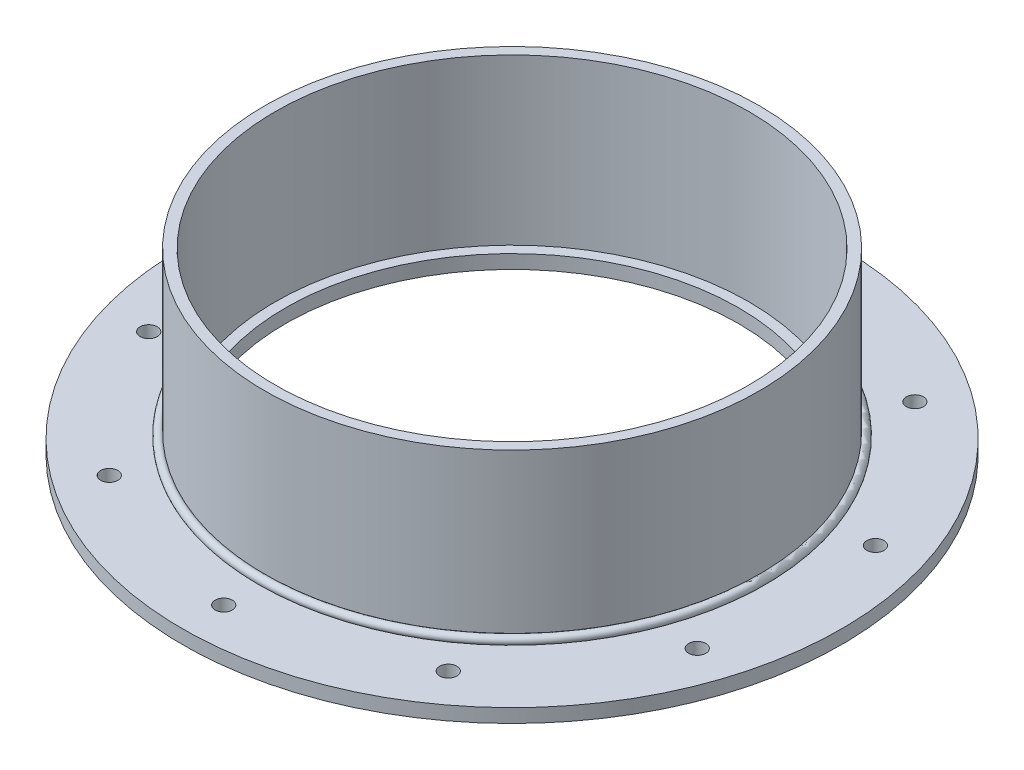
ISO-10303-21;
HEADER;
FILE_DESCRIPTION(('STEP AP214'),'2;1');
FILE_NAME('part.step','',(''),(''),'','','');
FILE_SCHEMA(('AUTOMOTIVE_DESIGN { 1 0 10303 214 1 1 1 1 }'));
ENDSEC;
DATA;
#1=APPLICATION_CONTEXT('core data for automotive mechanical design processes');
#2=APPLICATION_PROTOCOL_DEFINITION('international standard','automotive_design',2000,#1);
#3=PRODUCT_CONTEXT('',#1,'mechanical');
#4=PRODUCT('Part','Part','',(#3));
#5=PRODUCT_RELATED_PRODUCT_CATEGORY('part','',(#4));
#6=PRODUCT_DEFINITION_FORMATION('','',#4);
#7=PRODUCT_DEFINITION_CONTEXT('part definition',#1,'design');
#8=PRODUCT_DEFINITION('design','',#6,#7);
#9=PRODUCT_DEFINITION_SHAPE('','',#8);
#10=(LENGTH_UNIT() NAMED_UNIT(*) SI_UNIT(.MILLI.,.METRE.));
#11=(NAMED_UNIT(*) PLANE_ANGLE_UNIT() SI_UNIT($,.RADIAN.));
#12=(NAMED_UNIT(*) SI_UNIT($,.STERADIAN.) SOLID_ANGLE_UNIT());
#13=UNCERTAINTY_MEASURE_WITH_UNIT(LENGTH_MEASURE(1.E-05),#10,'distance_accuracy_value','');
#14=(GEOMETRIC_REPRESENTATION_CONTEXT(3) GLOBAL_UNCERTAINTY_ASSIGNED_CONTEXT((#13)) GLOBAL_UNIT_ASSIGNED_CONTEXT((#10,
#11,#12)) REPRESENTATION_CONTEXT('',''));
#15=CARTESIAN_POINT('',(0.,0.,0.));
#16=DIRECTION('',(0.,0.,1.));
#17=DIRECTION('',(1.,0.,0.));
#18=AXIS2_PLACEMENT_3D('',#15,#16,#17);
#19=CARTESIAN_POINT('',(0.,7.57337288963903,0.));
#20=DIRECTION('',(0.,-1.,0.));
#21=DIRECTION('',(0.,0.,-1.));
#22=AXIS2_PLACEMENT_3D('',#19,#20,#21);
#23=TOROIDAL_SURFACE('',#22,115.523372889639,1.98437499999999);
#24=CARTESIAN_POINT('',(0.,6.34999999999999,0.));
#25=DIRECTION('',(0.,-1.,0.));
#26=DIRECTION('',(0.,0.,-1.));
#27=AXIS2_PLACEMENT_3D('',#24,#25,#26);
#28=CIRCLE('',#27,117.085775818951);
#29=CARTESIAN_POINT('',(0.,6.34999999999999,-117.085775818951));
#30=VERTEX_POINT('',#29);
#31=EDGE_CURVE('E11',#30,#30,#28,.T.);
#32=ORIENTED_EDGE('',*,*,#31,.F.);
#33=EDGE_LOOP('',(#32));
#34=FACE_BOUND('',#33,.T.);
#35=CARTESIAN_POINT('',(0.,9.13577581895054,0.));
#36=DIRECTION('',(0.,-1.,0.));
#37=DIRECTION('',(0.,0.,-1.));
#38=AXIS2_PLACEMENT_3D('',#35,#36,#37);
#39=CIRCLE('',#38,114.3);
#40=CARTESIAN_POINT('',(0.,9.13577581895054,-114.3));
#41=VERTEX_POINT('',#40);
#42=EDGE_CURVE('E61',#41,#41,#39,.T.);
#43=ORIENTED_EDGE('',*,*,#42,.T.);
#44=EDGE_LOOP('',(#43));
#45=FACE_BOUND('',#44,.T.);
#46=ADVANCED_FACE('F48',(#34,#45),#23,.T.);
#47=CARTESIAN_POINT('',(-114.3,6.34999999999999,0.));
#48=DIRECTION('',(0.,1.,0.));
#49=DIRECTION('',(0.,0.,1.));
#50=AXIS2_PLACEMENT_3D('',#47,#48,#49);
#51=PLANE('',#50);
#52=CARTESIAN_POINT('',(0.,6.34999999999999,0.));
#53=DIRECTION('',(0.,-1.,0.));
#54=DIRECTION('',(0.,0.,-1.));
#55=AXIS2_PLACEMENT_3D('',#52,#53,#54);
#56=CIRCLE('',#55,114.3);
#57=CARTESIAN_POINT('',(0.,6.34999999999999,-114.3));
#58=VERTEX_POINT('',#57);
#59=EDGE_CURVE('E55',#58,#58,#56,.T.);
#60=ORIENTED_EDGE('',*,*,#59,.F.);
#61=EDGE_LOOP('',(#60));
#62=FACE_BOUND('',#61,.T.);
#63=ORIENTED_EDGE('',*,*,#31,.T.);
#64=EDGE_LOOP('',(#63));
#65=FACE_BOUND('',#64,.T.);
#66=ADVANCED_FACE('F74',(#62,#65),#51,.F.);
#67=CARTESIAN_POINT('',(0.,0.,0.));
#68=DIRECTION('',(0.,-1.,0.));
#69=DIRECTION('',(0.,0.,-1.));
#70=AXIS2_PLACEMENT_3D('',#67,#68,#69);
#71=CYLINDRICAL_SURFACE('',#70,114.3);
#72=ORIENTED_EDGE('',*,*,#42,.F.);
#73=EDGE_LOOP('',(#72));
#74=FACE_BOUND('',#73,.T.);
#75=ORIENTED_EDGE('',*,*,#59,.T.);
#76=EDGE_LOOP('',(#75));
#77=FACE_BOUND('',#76,.T.);
#78=ADVANCED_FACE('F72',(#74,#77),#71,.F.);
#79=CLOSED_SHELL('',(#46,#66,#78));
#80=MANIFOLD_SOLID_BREP('B2',#79);
#81=CARTESIAN_POINT('',(0.,0.,0.));
#82=DIRECTION('',(0.,-1.,0.));
#83=DIRECTION('',(0.,0.,-1.));
#84=AXIS2_PLACEMENT_3D('',#81,#82,#83);
#85=CYLINDRICAL_SURFACE('',#84,114.3);
#86=CARTESIAN_POINT('',(0.,6.34999999999999,0.));
#87=DIRECTION('',(0.,-1.,0.));
#88=DIRECTION('',(0.,0.,-1.));
#89=AXIS2_PLACEMENT_3D('',#86,#87,#88);
#90=CIRCLE('',#89,114.3);
#91=CARTESIAN_POINT('',(0.,6.34999999999999,-114.3));
#92=VERTEX_POINT('',#91);
#93=EDGE_CURVE('E133',#92,#92,#90,.T.);
#94=ORIENTED_EDGE('',*,*,#93,.F.);
#95=EDGE_LOOP('',(#94));
#96=FACE_BOUND('',#95,.T.);
#97=CARTESIAN_POINT('',(0.,82.55,0.));
#98=DIRECTION('',(0.,-1.,0.));
#99=DIRECTION('',(0.,0.,-1.));
#100=AXIS2_PLACEMENT_3D('',#97,#98,#99);
#101=CIRCLE('',#100,114.3);
#102=CARTESIAN_POINT('',(0.,82.55,-114.3));
#103=VERTEX_POINT('',#102);
#104=EDGE_CURVE('E47',#103,#103,#101,.T.);
#105=ORIENTED_EDGE('',*,*,#104,.T.);
#106=EDGE_LOOP('',(#105));
#107=FACE_BOUND('',#106,.T.);
#108=ADVANCED_FACE('F114',(#96,#107),#85,.T.);
#109=CARTESIAN_POINT('',(-114.3,82.55,0.));
#110=DIRECTION('',(0.,-1.,0.));
#111=DIRECTION('',(0.,0.,-1.));
#112=AXIS2_PLACEMENT_3D('',#109,#110,#111);
#113=PLANE('',#112);
#114=ORIENTED_EDGE('',*,*,#104,.F.);
#115=EDGE_LOOP('',(#114));
#116=FACE_BOUND('',#115,.T.);
#117=CARTESIAN_POINT('',(0.,82.55,0.));
#118=DIRECTION('',(0.,-1.,0.));
#119=DIRECTION('',(0.,0.,-1.));
#120=AXIS2_PLACEMENT_3D('',#117,#118,#119);
#121=CIRCLE('',#120,109.5375);
#122=CARTESIAN_POINT('',(0.,82.55,-109.5375));
#123=VERTEX_POINT('',#122);
#124=EDGE_CURVE('E121',#123,#123,#121,.T.);
#125=ORIENTED_EDGE('',*,*,#124,.T.);
#126=EDGE_LOOP('',(#125));
#127=FACE_BOUND('',#126,.T.);
#128=ADVANCED_FACE('F144',(#116,#127),#113,.F.);
#129=CARTESIAN_POINT('',(0.,0.,0.));
#130=DIRECTION('',(0.,-1.,0.));
#131=DIRECTION('',(0.,0.,-1.));
#132=AXIS2_PLACEMENT_3D('',#129,#130,#131);
#133=CYLINDRICAL_SURFACE('',#132,109.5375);
#134=ORIENTED_EDGE('',*,*,#124,.F.);
#135=EDGE_LOOP('',(#134));
#136=FACE_BOUND('',#135,.T.);
#137=CARTESIAN_POINT('',(0.,6.34999999999999,0.));
#138=DIRECTION('',(0.,-1.,0.));
#139=DIRECTION('',(0.,0.,-1.));
#140=AXIS2_PLACEMENT_3D('',#137,#138,#139);
#141=CIRCLE('',#140,109.5375);
#142=CARTESIAN_POINT('',(0.,6.34999999999999,-109.5375));
#143=VERTEX_POINT('',#142);
#144=EDGE_CURVE('E127',#143,#143,#141,.T.);
#145=ORIENTED_EDGE('',*,*,#144,.T.);
#146=EDGE_LOOP('',(#145));
#147=FACE_BOUND('',#146,.T.);
#148=ADVANCED_FACE('F148',(#136,#147),#133,.F.);
#149=CARTESIAN_POINT('',(-114.3,6.34999999999999,0.));
#150=DIRECTION('',(0.,1.,0.));
#151=DIRECTION('',(0.,0.,1.));
#152=AXIS2_PLACEMENT_3D('',#149,#150,#151);
#153=PLANE('',#152);
#154=ORIENTED_EDGE('',*,*,#144,.F.);
#155=EDGE_LOOP('',(#154));
#156=FACE_BOUND('',#155,.T.);
#157=ORIENTED_EDGE('',*,*,#93,.T.);
#158=EDGE_LOOP('',(#157));
#159=FACE_BOUND('',#158,.T.);
#160=ADVANCED_FACE('F141',(#156,#159),#153,.F.);
#161=CLOSED_SHELL('',(#108,#128,#148,#160));
#162=MANIFOLD_SOLID_BREP('B6',#161);
#163=CARTESIAN_POINT('',(0.,0.,0.));
#164=DIRECTION('',(0.,-1.,0.));
#165=DIRECTION('',(0.,0.,-1.));
#166=AXIS2_PLACEMENT_3D('',#163,#164,#165);
#167=CYLINDRICAL_SURFACE('',#166,104.775);
#168=CARTESIAN_POINT('',(0.,6.34999999999999,0.));
#169=DIRECTION('',(0.,-1.,0.));
#170=DIRECTION('',(0.,0.,-1.));
#171=AXIS2_PLACEMENT_3D('',#168,#169,#170);
#172=CIRCLE('',#171,104.775);
#173=CARTESIAN_POINT('',(0.,6.34999999999999,-104.775));
#174=VERTEX_POINT('',#173);
#175=EDGE_CURVE('E113',#174,#174,#172,.T.);
#176=ORIENTED_EDGE('',*,*,#175,.F.);
#177=EDGE_LOOP('',(#176));
#178=FACE_BOUND('',#177,.T.);
#179=CARTESIAN_POINT('',(0.,0.,0.));
#180=DIRECTION('',(0.,-1.,0.));
#181=DIRECTION('',(0.,0.,-1.));
#182=AXIS2_PLACEMENT_3D('',#179,#180,#181);
#183=CIRCLE('',#182,104.775);
#184=CARTESIAN_POINT('',(0.,0.,-104.775));
#185=VERTEX_POINT('',#184);
#186=EDGE_CURVE('E211',#185,#185,#183,.T.);
#187=ORIENTED_EDGE('',*,*,#186,.T.);
#188=EDGE_LOOP('',(#187));
#189=FACE_BOUND('',#188,.T.);
#190=ADVANCED_FACE('F192',(#178,#189),#167,.F.);
#191=CARTESIAN_POINT('',(-104.775,6.34999999999999,0.));
#192=DIRECTION('',(0.,-1.,0.));
#193=DIRECTION('',(0.,0.,-1.));
#194=AXIS2_PLACEMENT_3D('',#191,#192,#193);
#195=PLANE('',#194);
#196=CARTESIAN_POINT('',(-78.3811633931999,6.34999999999999,-107.8824161999));
#197=DIRECTION('',(0.,1.,0.));
#198=DIRECTION('',(0.587785252292462,0.,0.809016994374955));
#199=AXIS2_PLACEMENT_3D('',#196,#197,#198);
#200=CIRCLE('',#199,3.96875);
#201=CARTESIAN_POINT('',(-76.0483906731642,6.34999999999999,-104.671630003475));
#202=VERTEX_POINT('',#201);
#203=EDGE_CURVE('E290',#202,#202,#200,.T.);
#204=ORIENTED_EDGE('',*,*,#203,.F.);
#205=EDGE_LOOP('',(#204));
#206=FACE_BOUND('',#205,.T.);
#207=CARTESIAN_POINT('',(-126.823386447958,6.34999999999999,-41.2074161999007));
#208=DIRECTION('',(0.,1.,0.));
#209=DIRECTION('',(0.95105651629515,0.,0.309016994374958));
#210=AXIS2_PLACEMENT_3D('',#207,#208,#209);
#211=CIRCLE('',#210,3.96875);
#212=CARTESIAN_POINT('',(-123.048880898912,6.34999999999999,-39.9810050034751));
#213=VERTEX_POINT('',#212);
#214=EDGE_CURVE('E282',#213,#213,#211,.T.);
#215=ORIENTED_EDGE('',*,*,#214,.F.);
#216=EDGE_LOOP('',(#215));
#217=FACE_BOUND('',#216,.T.);
#218=CARTESIAN_POINT('',(-126.823386447959,6.34999999999999,41.207416199898));
#219=DIRECTION('',(0.,1.,0.));
#220=DIRECTION('',(0.951056516295157,0.,-0.309016994374938));
#221=AXIS2_PLACEMENT_3D('',#218,#219,#220);
#222=CIRCLE('',#221,3.96875);
#223=CARTESIAN_POINT('',(-123.048880898913,6.34999999999999,39.9810050034725));
#224=VERTEX_POINT('',#223);
#225=EDGE_CURVE('E274',#224,#224,#222,.T.);
#226=ORIENTED_EDGE('',*,*,#225,.F.);
#227=EDGE_LOOP('',(#226));
#228=FACE_BOUND('',#227,.T.);
#229=CARTESIAN_POINT('',(-78.3811633932022,6.34999999999999,107.882416199899));
#230=DIRECTION('',(0.,1.,0.));
#231=DIRECTION('',(0.58778525229248,0.,-0.809016994374942));
#232=AXIS2_PLACEMENT_3D('',#229,#230,#231);
#233=CIRCLE('',#232,3.96875);
#234=CARTESIAN_POINT('',(-76.0483906731665,6.34999999999999,104.671630003473));
#235=VERTEX_POINT('',#234);
#236=EDGE_CURVE('E266',#235,#235,#233,.T.);
#237=ORIENTED_EDGE('',*,*,#236,.F.);
#238=EDGE_LOOP('',(#237));
#239=FACE_BOUND('',#238,.T.);
#240=CARTESIAN_POINT('',(0.,6.34999999999999,133.35));
#241=DIRECTION('',(0.,1.,0.));
#242=DIRECTION('',(0.,0.,-1.));
#243=AXIS2_PLACEMENT_3D('',#240,#241,#242);
#244=CIRCLE('',#243,3.96875);
#245=CARTESIAN_POINT('',(0.,6.34999999999999,129.38125));
#246=VERTEX_POINT('',#245);
#247=EDGE_CURVE('E258',#246,#246,#244,.T.);
#248=ORIENTED_EDGE('',*,*,#247,.F.);
#249=EDGE_LOOP('',(#248));
#250=FACE_BOUND('',#249,.T.);
#251=CARTESIAN_POINT('',(78.3811633932007,6.34999999999999,107.8824161999));
#252=DIRECTION('',(0.,1.,0.));
#253=DIRECTION('',(-0.587785252292469,0.,-0.809016994374951));
#254=AXIS2_PLACEMENT_3D('',#251,#252,#253);
#255=CIRCLE('',#254,3.96875);
#256=CARTESIAN_POINT('',(76.0483906731649,6.34999999999999,104.671630003474));
#257=VERTEX_POINT('',#256);
#258=EDGE_CURVE('E250',#257,#257,#255,.T.);
#259=ORIENTED_EDGE('',*,*,#258,.F.);
#260=EDGE_LOOP('',(#259));
#261=FACE_BOUND('',#260,.T.);
#262=CARTESIAN_POINT('',(126.823386447959,6.34999999999999,41.2074161998998));
#263=DIRECTION('',(0.,1.,0.));
#264=DIRECTION('',(-0.951056516295152,0.,-0.309016994374952));
#265=AXIS2_PLACEMENT_3D('',#262,#263,#264);
#266=CIRCLE('',#265,3.96875);
#267=CARTESIAN_POINT('',(123.048880898912,6.34999999999999,39.9810050034742));
#268=VERTEX_POINT('',#267);
#269=EDGE_CURVE('E242',#268,#268,#266,.T.);
#270=ORIENTED_EDGE('',*,*,#269,.F.);
#271=EDGE_LOOP('',(#270));
#272=FACE_BOUND('',#271,.T.);
#273=CARTESIAN_POINT('',(126.823386447959,6.34999999999999,-41.2074161998989));
#274=DIRECTION('',(0.,1.,0.));
#275=DIRECTION('',(-0.951056516295155,0.,0.309016994374945));
#276=AXIS2_PLACEMENT_3D('',#273,#274,#275);
#277=CIRCLE('',#276,3.96875);
#278=CARTESIAN_POINT('',(123.048880898912,6.34999999999999,-39.9810050034733));
#279=VERTEX_POINT('',#278);
#280=EDGE_CURVE('E234',#279,#279,#277,.T.);
#281=ORIENTED_EDGE('',*,*,#280,.F.);
#282=EDGE_LOOP('',(#281));
#283=FACE_BOUND('',#282,.T.);
#284=CARTESIAN_POINT('',(78.3811633932014,6.34999999999999,-107.882416199899));
#285=DIRECTION('',(0.,1.,0.));
#286=DIRECTION('',(-0.587785252292474,0.,0.809016994374947));
#287=AXIS2_PLACEMENT_3D('',#284,#285,#286);
#288=CIRCLE('',#287,3.96875);
#289=CARTESIAN_POINT('',(76.0483906731657,6.34999999999999,-104.671630003474));
#290=VERTEX_POINT('',#289);
#291=EDGE_CURVE('E226',#290,#290,#288,.T.);
#292=ORIENTED_EDGE('',*,*,#291,.F.);
#293=EDGE_LOOP('',(#292));
#294=FACE_BOUND('',#293,.T.);
#295=CARTESIAN_POINT('',(0.,6.34999999999999,-133.35));
#296=DIRECTION('',(0.,1.,0.));
#297=DIRECTION('',(0.,0.,1.));
#298=AXIS2_PLACEMENT_3D('',#295,#296,#297);
#299=CIRCLE('',#298,3.96875);
#300=CARTESIAN_POINT('',(0.,6.34999999999999,-129.38125));
#301=VERTEX_POINT('',#300);
#302=EDGE_CURVE('E218',#301,#301,#299,.T.);
#303=ORIENTED_EDGE('',*,*,#302,.F.);
#304=EDGE_LOOP('',(#303));
#305=FACE_BOUND('',#304,.T.);
#306=CARTESIAN_POINT('',(0.,6.34999999999999,0.));
#307=DIRECTION('',(0.,-1.,0.));
#308=DIRECTION('',(0.,0.,-1.));
#309=AXIS2_PLACEMENT_3D('',#306,#307,#308);
#310=CIRCLE('',#309,152.4);
#311=CARTESIAN_POINT('',(0.,6.34999999999999,-152.4));
#312=VERTEX_POINT('',#311);
#313=EDGE_CURVE('E199',#312,#312,#310,.T.);
#314=ORIENTED_EDGE('',*,*,#313,.F.);
#315=EDGE_LOOP('',(#314));
#316=FACE_BOUND('',#315,.T.);
#317=ORIENTED_EDGE('',*,*,#175,.T.);
#318=EDGE_LOOP('',(#317));
#319=FACE_BOUND('',#318,.T.);
#320=ADVANCED_FACE('F309',(#206,#217,#228,#239,#250,#261,#272,#283,#294,#305,#316,#319),#195,.F.);
#321=CARTESIAN_POINT('',(0.,0.,0.));
#322=DIRECTION('',(0.,-1.,0.));
#323=DIRECTION('',(0.,0.,-1.));
#324=AXIS2_PLACEMENT_3D('',#321,#322,#323);
#325=CYLINDRICAL_SURFACE('',#324,152.4);
#326=CARTESIAN_POINT('',(0.,0.,0.));
#327=DIRECTION('',(0.,-1.,0.));
#328=DIRECTION('',(0.,0.,-1.));
#329=AXIS2_PLACEMENT_3D('',#326,#327,#328);
#330=CIRCLE('',#329,152.4);
#331=CARTESIAN_POINT('',(0.,0.,-152.4));
#332=VERTEX_POINT('',#331);
#333=EDGE_CURVE('E205',#332,#332,#330,.T.);
#334=ORIENTED_EDGE('',*,*,#333,.F.);
#335=EDGE_LOOP('',(#334));
#336=FACE_BOUND('',#335,.T.);
#337=ORIENTED_EDGE('',*,*,#313,.T.);
#338=EDGE_LOOP('',(#337));
#339=FACE_BOUND('',#338,.T.);
#340=ADVANCED_FACE('F312',(#336,#339),#325,.T.);
#341=CARTESIAN_POINT('',(-104.775,0.,0.));
#342=DIRECTION('',(0.,1.,0.));
#343=DIRECTION('',(0.,0.,1.));
#344=AXIS2_PLACEMENT_3D('',#341,#342,#343);
#345=PLANE('',#344);
#346=CARTESIAN_POINT('',(-78.3811633931999,0.,-107.8824161999));
#347=DIRECTION('',(0.,1.,0.));
#348=DIRECTION('',(0.587785252292462,0.,0.809016994374955));
#349=AXIS2_PLACEMENT_3D('',#346,#347,#348);
#350=CIRCLE('',#349,3.96875);
#351=CARTESIAN_POINT('',(-76.0483906731642,0.,-104.671630003475));
#352=VERTEX_POINT('',#351);
#353=EDGE_CURVE('E286',#352,#352,#350,.T.);
#354=ORIENTED_EDGE('',*,*,#353,.T.);
#355=EDGE_LOOP('',(#354));
#356=FACE_BOUND('',#355,.T.);
#357=CARTESIAN_POINT('',(-126.823386447958,0.,-41.2074161999007));
#358=DIRECTION('',(0.,1.,0.));
#359=DIRECTION('',(0.95105651629515,0.,0.309016994374958));
#360=AXIS2_PLACEMENT_3D('',#357,#358,#359);
#361=CIRCLE('',#360,3.96875);
#362=CARTESIAN_POINT('',(-123.048880898912,0.,-39.9810050034751));
#363=VERTEX_POINT('',#362);
#364=EDGE_CURVE('E278',#363,#363,#361,.T.);
#365=ORIENTED_EDGE('',*,*,#364,.T.);
#366=EDGE_LOOP('',(#365));
#367=FACE_BOUND('',#366,.T.);
#368=CARTESIAN_POINT('',(-126.823386447959,0.,41.207416199898));
#369=DIRECTION('',(0.,1.,0.));
#370=DIRECTION('',(0.951056516295157,0.,-0.309016994374938));
#371=AXIS2_PLACEMENT_3D('',#368,#369,#370);
#372=CIRCLE('',#371,3.96875);
#373=CARTESIAN_POINT('',(-123.048880898913,0.,39.9810050034725));
#374=VERTEX_POINT('',#373);
#375=EDGE_CURVE('E270',#374,#374,#372,.T.);
#376=ORIENTED_EDGE('',*,*,#375,.T.);
#377=EDGE_LOOP('',(#376));
#378=FACE_BOUND('',#377,.T.);
#379=CARTESIAN_POINT('',(-78.3811633932022,0.,107.882416199899));
#380=DIRECTION('',(0.,1.,0.));
#381=DIRECTION('',(0.58778525229248,0.,-0.809016994374942));
#382=AXIS2_PLACEMENT_3D('',#379,#380,#381);
#383=CIRCLE('',#382,3.96875);
#384=CARTESIAN_POINT('',(-76.0483906731665,0.,104.671630003473));
#385=VERTEX_POINT('',#384);
#386=EDGE_CURVE('E262',#385,#385,#383,.T.);
#387=ORIENTED_EDGE('',*,*,#386,.T.);
#388=EDGE_LOOP('',(#387));
#389=FACE_BOUND('',#388,.T.);
#390=CARTESIAN_POINT('',(0.,0.,133.35));
#391=DIRECTION('',(0.,1.,0.));
#392=DIRECTION('',(0.,0.,-1.));
#393=AXIS2_PLACEMENT_3D('',#390,#391,#392);
#394=CIRCLE('',#393,3.96875);
#395=CARTESIAN_POINT('',(0.,0.,129.38125));
#396=VERTEX_POINT('',#395);
#397=EDGE_CURVE('E254',#396,#396,#394,.T.);
#398=ORIENTED_EDGE('',*,*,#397,.T.);
#399=EDGE_LOOP('',(#398));
#400=FACE_BOUND('',#399,.T.);
#401=CARTESIAN_POINT('',(78.3811633932007,0.,107.8824161999));
#402=DIRECTION('',(0.,1.,0.));
#403=DIRECTION('',(-0.587785252292469,0.,-0.809016994374951));
#404=AXIS2_PLACEMENT_3D('',#401,#402,#403);
#405=CIRCLE('',#404,3.96875);
#406=CARTESIAN_POINT('',(76.0483906731649,0.,104.671630003474));
#407=VERTEX_POINT('',#406);
#408=EDGE_CURVE('E246',#407,#407,#405,.T.);
#409=ORIENTED_EDGE('',*,*,#408,.T.);
#410=EDGE_LOOP('',(#409));
#411=FACE_BOUND('',#410,.T.);
#412=CARTESIAN_POINT('',(126.823386447959,0.,41.2074161998998));
#413=DIRECTION('',(0.,1.,0.));
#414=DIRECTION('',(-0.951056516295152,0.,-0.309016994374952));
#415=AXIS2_PLACEMENT_3D('',#412,#413,#414);
#416=CIRCLE('',#415,3.96875);
#417=CARTESIAN_POINT('',(123.048880898912,0.,39.9810050034742));
#418=VERTEX_POINT('',#417);
#419=EDGE_CURVE('E238',#418,#418,#416,.T.);
#420=ORIENTED_EDGE('',*,*,#419,.T.);
#421=EDGE_LOOP('',(#420));
#422=FACE_BOUND('',#421,.T.);
#423=CARTESIAN_POINT('',(126.823386447959,0.,-41.2074161998989));
#424=DIRECTION('',(0.,1.,0.));
#425=DIRECTION('',(-0.951056516295155,0.,0.309016994374945));
#426=AXIS2_PLACEMENT_3D('',#423,#424,#425);
#427=CIRCLE('',#426,3.96875);
#428=CARTESIAN_POINT('',(123.048880898912,0.,-39.9810050034733));
#429=VERTEX_POINT('',#428);
#430=EDGE_CURVE('E230',#429,#429,#427,.T.);
#431=ORIENTED_EDGE('',*,*,#430,.T.);
#432=EDGE_LOOP('',(#431));
#433=FACE_BOUND('',#432,.T.);
#434=CARTESIAN_POINT('',(78.3811633932014,0.,-107.882416199899));
#435=DIRECTION('',(0.,1.,0.));
#436=DIRECTION('',(-0.587785252292474,0.,0.809016994374947));
#437=AXIS2_PLACEMENT_3D('',#434,#435,#436);
#438=CIRCLE('',#437,3.96875);
#439=CARTESIAN_POINT('',(76.0483906731657,0.,-104.671630003474));
#440=VERTEX_POINT('',#439);
#441=EDGE_CURVE('E222',#440,#440,#438,.T.);
#442=ORIENTED_EDGE('',*,*,#441,.T.);
#443=EDGE_LOOP('',(#442));
#444=FACE_BOUND('',#443,.T.);
#445=CARTESIAN_POINT('',(0.,0.,-133.35));
#446=DIRECTION('',(0.,1.,0.));
#447=DIRECTION('',(0.,0.,1.));
#448=AXIS2_PLACEMENT_3D('',#445,#446,#447);
#449=CIRCLE('',#448,3.96875);
#450=CARTESIAN_POINT('',(0.,0.,-129.38125));
#451=VERTEX_POINT('',#450);
#452=EDGE_CURVE('E217',#451,#451,#449,.T.);
#453=ORIENTED_EDGE('',*,*,#452,.T.);
#454=EDGE_LOOP('',(#453));
#455=FACE_BOUND('',#454,.T.);
#456=ORIENTED_EDGE('',*,*,#186,.F.);
#457=EDGE_LOOP('',(#456));
#458=FACE_BOUND('',#457,.T.);
#459=ORIENTED_EDGE('',*,*,#333,.T.);
#460=EDGE_LOOP('',(#459));
#461=FACE_BOUND('',#460,.T.);
#462=ADVANCED_FACE('F299',(#356,#367,#378,#389,#400,#411,#422,#433,#444,#455,#458,#461),#345,.F.);
#463=CARTESIAN_POINT('',(0.,0.,-133.35));
#464=DIRECTION('',(0.,1.,0.));
#465=DIRECTION('',(0.,0.,1.));
#466=AXIS2_PLACEMENT_3D('',#463,#464,#465);
#467=CYLINDRICAL_SURFACE('',#466,3.96875);
#468=ORIENTED_EDGE('',*,*,#452,.F.);
#469=EDGE_LOOP('',(#468));
#470=FACE_BOUND('',#469,.T.);
#471=ORIENTED_EDGE('',*,*,#302,.T.);
#472=EDGE_LOOP('',(#471));
#473=FACE_BOUND('',#472,.T.);
#474=ADVANCED_FACE('F332',(#470,#473),#467,.F.);
#475=CARTESIAN_POINT('',(78.3811633932014,0.,-107.882416199899));
#476=DIRECTION('',(0.,1.,0.));
#477=DIRECTION('',(0.,0.,1.));
#478=AXIS2_PLACEMENT_3D('',#475,#476,#477);
#479=CYLINDRICAL_SURFACE('',#478,3.96875);
#480=ORIENTED_EDGE('',*,*,#441,.F.);
#481=EDGE_LOOP('',(#480));
#482=FACE_BOUND('',#481,.T.);
#483=ORIENTED_EDGE('',*,*,#291,.T.);
#484=EDGE_LOOP('',(#483));
#485=FACE_BOUND('',#484,.T.);
#486=ADVANCED_FACE('F334',(#482,#485),#479,.F.);
#487=CARTESIAN_POINT('',(126.823386447959,0.,-41.2074161998989));
#488=DIRECTION('',(0.,1.,0.));
#489=DIRECTION('',(0.,0.,1.));
#490=AXIS2_PLACEMENT_3D('',#487,#488,#489);
#491=CYLINDRICAL_SURFACE('',#490,3.96875);
#492=ORIENTED_EDGE('',*,*,#430,.F.);
#493=EDGE_LOOP('',(#492));
#494=FACE_BOUND('',#493,.T.);
#495=ORIENTED_EDGE('',*,*,#280,.T.);
#496=EDGE_LOOP('',(#495));
#497=FACE_BOUND('',#496,.T.);
#498=ADVANCED_FACE('F341',(#494,#497),#491,.F.);
#499=CARTESIAN_POINT('',(126.823386447959,0.,41.2074161998998));
#500=DIRECTION('',(0.,1.,0.));
#501=DIRECTION('',(0.,0.,1.));
#502=AXIS2_PLACEMENT_3D('',#499,#500,#501);
#503=CYLINDRICAL_SURFACE('',#502,3.96875);
#504=ORIENTED_EDGE('',*,*,#419,.F.);
#505=EDGE_LOOP('',(#504));
#506=FACE_BOUND('',#505,.T.);
#507=ORIENTED_EDGE('',*,*,#269,.T.);
#508=EDGE_LOOP('',(#507));
#509=FACE_BOUND('',#508,.T.);
#510=ADVANCED_FACE('F386',(#506,#509),#503,.F.);
#511=CARTESIAN_POINT('',(78.3811633932007,0.,107.8824161999));
#512=DIRECTION('',(0.,1.,0.));
#513=DIRECTION('',(0.,0.,1.));
#514=AXIS2_PLACEMENT_3D('',#511,#512,#513);
#515=CYLINDRICAL_SURFACE('',#514,3.96875);
#516=ORIENTED_EDGE('',*,*,#408,.F.);
#517=EDGE_LOOP('',(#516));
#518=FACE_BOUND('',#517,.T.);
#519=ORIENTED_EDGE('',*,*,#258,.T.);
#520=EDGE_LOOP('',(#519));
#521=FACE_BOUND('',#520,.T.);
#522=ADVANCED_FACE('F396',(#518,#521),#515,.F.);
#523=CARTESIAN_POINT('',(0.,0.,133.35));
#524=DIRECTION('',(0.,1.,0.));
#525=DIRECTION('',(0.,0.,1.));
#526=AXIS2_PLACEMENT_3D('',#523,#524,#525);
#527=CYLINDRICAL_SURFACE('',#526,3.96875);
#528=ORIENTED_EDGE('',*,*,#397,.F.);
#529=EDGE_LOOP('',(#528));
#530=FACE_BOUND('',#529,.T.);
#531=ORIENTED_EDGE('',*,*,#247,.T.);
#532=EDGE_LOOP('',(#531));
#533=FACE_BOUND('',#532,.T.);
#534=ADVANCED_FACE('F406',(#530,#533),#527,.F.);
#535=CARTESIAN_POINT('',(-78.3811633932022,0.,107.882416199899));
#536=DIRECTION('',(0.,1.,0.));
#537=DIRECTION('',(0.,0.,1.));
#538=AXIS2_PLACEMENT_3D('',#535,#536,#537);
#539=CYLINDRICAL_SURFACE('',#538,3.96875);
#540=ORIENTED_EDGE('',*,*,#386,.F.);
#541=EDGE_LOOP('',(#540));
#542=FACE_BOUND('',#541,.T.);
#543=ORIENTED_EDGE('',*,*,#236,.T.);
#544=EDGE_LOOP('',(#543));
#545=FACE_BOUND('',#544,.T.);
#546=ADVANCED_FACE('F416',(#542,#545),#539,.F.);
#547=CARTESIAN_POINT('',(-126.823386447959,0.,41.207416199898));
#548=DIRECTION('',(0.,1.,0.));
#549=DIRECTION('',(0.,0.,1.));
#550=AXIS2_PLACEMENT_3D('',#547,#548,#549);
#551=CYLINDRICAL_SURFACE('',#550,3.96875);
#552=ORIENTED_EDGE('',*,*,#375,.F.);
#553=EDGE_LOOP('',(#552));
#554=FACE_BOUND('',#553,.T.);
#555=ORIENTED_EDGE('',*,*,#225,.T.);
#556=EDGE_LOOP('',(#555));
#557=FACE_BOUND('',#556,.T.);
#558=ADVANCED_FACE('F426',(#554,#557),#551,.F.);
#559=CARTESIAN_POINT('',(-126.823386447958,0.,-41.2074161999007));
#560=DIRECTION('',(0.,1.,0.));
#561=DIRECTION('',(0.,0.,1.));
#562=AXIS2_PLACEMENT_3D('',#559,#560,#561);
#563=CYLINDRICAL_SURFACE('',#562,3.96875);
#564=ORIENTED_EDGE('',*,*,#364,.F.);
#565=EDGE_LOOP('',(#564));
#566=FACE_BOUND('',#565,.T.);
#567=ORIENTED_EDGE('',*,*,#214,.T.);
#568=EDGE_LOOP('',(#567));
#569=FACE_BOUND('',#568,.T.);
#570=ADVANCED_FACE('F305',(#566,#569),#563,.F.);
#571=CARTESIAN_POINT('',(-78.3811633931999,0.,-107.8824161999));
#572=DIRECTION('',(0.,1.,0.));
#573=DIRECTION('',(0.,0.,1.));
#574=AXIS2_PLACEMENT_3D('',#571,#572,#573);
#575=CYLINDRICAL_SURFACE('',#574,3.96875);
#576=ORIENTED_EDGE('',*,*,#353,.F.);
#577=EDGE_LOOP('',(#576));
#578=FACE_BOUND('',#577,.T.);
#579=ORIENTED_EDGE('',*,*,#203,.T.);
#580=EDGE_LOOP('',(#579));
#581=FACE_BOUND('',#580,.T.);
#582=ADVANCED_FACE('F302',(#578,#581),#575,.F.);
#583=CLOSED_SHELL('',(#190,#320,#340,#462,#474,#486,#498,#510,#522,#534,#546,#558,#570,#582));
#584=MANIFOLD_SOLID_BREP('B42',#583);
#585=ADVANCED_BREP_SHAPE_REPRESENTATION('',(#18,#80,#162,#584),#14);
#586=SHAPE_DEFINITION_REPRESENTATION(#9,#585);
ENDSEC;
END-ISO-10303-21;
